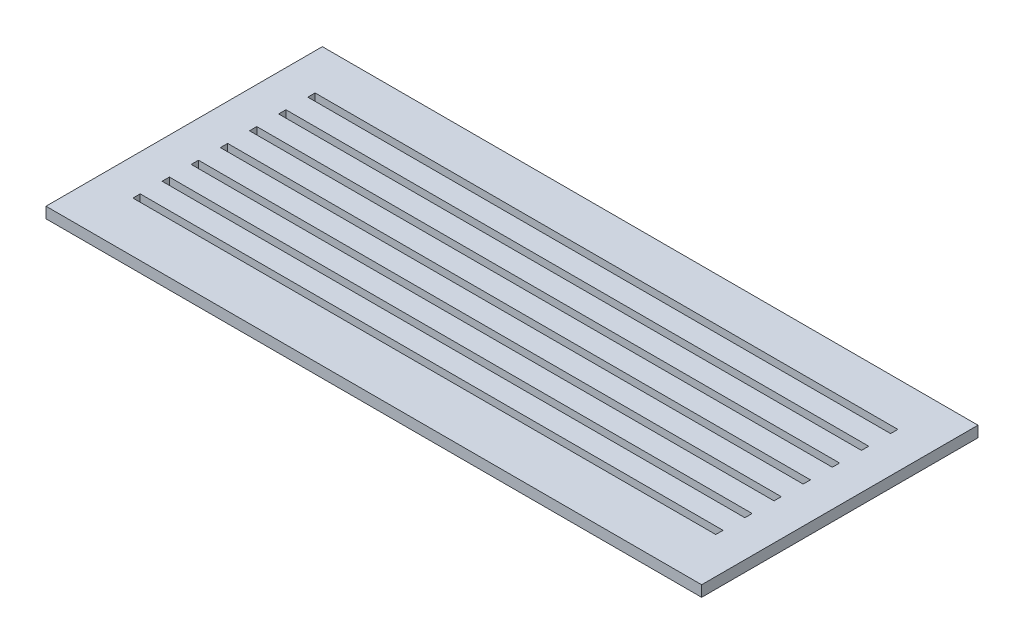
ISO-10303-21;
HEADER;
FILE_DESCRIPTION(('STEP AP214'),'2;1');
FILE_NAME('part.step','',(''),(''),'','','');
FILE_SCHEMA(('AUTOMOTIVE_DESIGN { 1 0 10303 214 1 1 1 1 }'));
ENDSEC;
DATA;
#1=APPLICATION_CONTEXT('core data for automotive mechanical design processes');
#2=APPLICATION_PROTOCOL_DEFINITION('international standard','automotive_design',2000,#1);
#3=PRODUCT_CONTEXT('',#1,'mechanical');
#4=PRODUCT('Part','Part','',(#3));
#5=PRODUCT_RELATED_PRODUCT_CATEGORY('part','',(#4));
#6=PRODUCT_DEFINITION_FORMATION('','',#4);
#7=PRODUCT_DEFINITION_CONTEXT('part definition',#1,'design');
#8=PRODUCT_DEFINITION('design','',#6,#7);
#9=PRODUCT_DEFINITION_SHAPE('','',#8);
#10=(LENGTH_UNIT() NAMED_UNIT(*) SI_UNIT(.MILLI.,.METRE.));
#11=(NAMED_UNIT(*) PLANE_ANGLE_UNIT() SI_UNIT($,.RADIAN.));
#12=(NAMED_UNIT(*) SI_UNIT($,.STERADIAN.) SOLID_ANGLE_UNIT());
#13=UNCERTAINTY_MEASURE_WITH_UNIT(LENGTH_MEASURE(1.E-05),#10,'distance_accuracy_value','');
#14=(GEOMETRIC_REPRESENTATION_CONTEXT(3) GLOBAL_UNCERTAINTY_ASSIGNED_CONTEXT((#13)) GLOBAL_UNIT_ASSIGNED_CONTEXT((#10,
#11,#12)) REPRESENTATION_CONTEXT('',''));
#15=CARTESIAN_POINT('',(0.,0.,0.));
#16=DIRECTION('',(0.,0.,1.));
#17=DIRECTION('',(1.,0.,0.));
#18=AXIS2_PLACEMENT_3D('',#15,#16,#17);
#19=CARTESIAN_POINT('',(0.,3.,0.));
#20=DIRECTION('',(0.,1.,0.));
#21=DIRECTION('',(0.,0.,1.));
#22=AXIS2_PLACEMENT_3D('',#19,#20,#21);
#23=PLANE('',#22);
#24=DIRECTION('',(0.,0.,1.));
#25=VECTOR('',#24,1.);
#26=CARTESIAN_POINT('',(-95.5669699429958,3.,-45.3964757709251));
#27=LINE('',#26,#25);
#28=CARTESIAN_POINT('',(-95.5669699429958,3.,-45.3964757709251));
#29=VERTEX_POINT('',#28);
#30=CARTESIAN_POINT('',(-95.5669699429957,3.,30.4735242290749));
#31=VERTEX_POINT('',#30);
#32=EDGE_CURVE('E464',#29,#31,#27,.T.);
#33=ORIENTED_EDGE('',*,*,#32,.T.);
#34=DIRECTION('',(1.,0.,0.));
#35=VECTOR('',#34,1.);
#36=CARTESIAN_POINT('',(-95.5669699429957,3.,30.4735242290749));
#37=LINE('',#36,#35);
#38=CARTESIAN_POINT('',(84.4330300570043,3.,30.4735242290749));
#39=VERTEX_POINT('',#38);
#40=EDGE_CURVE('E467',#31,#39,#37,.T.);
#41=ORIENTED_EDGE('',*,*,#40,.T.);
#42=DIRECTION('',(0.,0.,-1.));
#43=VECTOR('',#42,1.);
#44=CARTESIAN_POINT('',(84.4330300570043,3.,-45.3964757709251));
#45=LINE('',#44,#43);
#46=CARTESIAN_POINT('',(84.4330300570043,3.,-45.3964757709251));
#47=VERTEX_POINT('',#46);
#48=EDGE_CURVE('E470',#39,#47,#45,.T.);
#49=ORIENTED_EDGE('',*,*,#48,.T.);
#50=DIRECTION('',(-1.,0.,0.));
#51=VECTOR('',#50,1.);
#52=CARTESIAN_POINT('',(-95.5669699429958,3.,-45.3964757709251));
#53=LINE('',#52,#51);
#54=EDGE_CURVE('E472',#47,#29,#53,.T.);
#55=ORIENTED_EDGE('',*,*,#54,.T.);
#56=EDGE_LOOP('',(#33,#41,#49,#55));
#57=FACE_BOUND('',#56,.T.);
#58=DIRECTION('',(1.,0.,0.));
#59=VECTOR('',#58,1.);
#60=CARTESIAN_POINT('',(-85.5669699429958,3.,-31.3964757709251));
#61=LINE('',#60,#59);
#62=CARTESIAN_POINT('',(-85.5669699429958,3.,-31.3964757709251));
#63=VERTEX_POINT('',#62);
#64=CARTESIAN_POINT('',(74.4330300570042,3.,-31.3964757709251));
#65=VERTEX_POINT('',#64);
#66=EDGE_CURVE('E435',#63,#65,#61,.T.);
#67=ORIENTED_EDGE('',*,*,#66,.F.);
#68=DIRECTION('',(0.,0.,1.));
#69=VECTOR('',#68,1.);
#70=CARTESIAN_POINT('',(-85.5669699429958,3.,-33.3964757709251));
#71=LINE('',#70,#69);
#72=CARTESIAN_POINT('',(-85.5669699429958,3.,-33.3964757709251));
#73=VERTEX_POINT('',#72);
#74=EDGE_CURVE('E433',#73,#63,#71,.T.);
#75=ORIENTED_EDGE('',*,*,#74,.F.);
#76=DIRECTION('',(-1.,0.,0.));
#77=VECTOR('',#76,1.);
#78=CARTESIAN_POINT('',(-85.5669699429958,3.,-33.3964757709251));
#79=LINE('',#78,#77);
#80=CARTESIAN_POINT('',(74.4330300570042,3.,-33.3964757709251));
#81=VERTEX_POINT('',#80);
#82=EDGE_CURVE('E441',#81,#73,#79,.T.);
#83=ORIENTED_EDGE('',*,*,#82,.F.);
#84=DIRECTION('',(0.,0.,-1.));
#85=VECTOR('',#84,1.);
#86=CARTESIAN_POINT('',(74.4330300570042,3.,-33.3964757709251));
#87=LINE('',#86,#85);
#88=EDGE_CURVE('E438',#65,#81,#87,.T.);
#89=ORIENTED_EDGE('',*,*,#88,.F.);
#90=EDGE_LOOP('',(#67,#75,#83,#89));
#91=FACE_BOUND('',#90,.T.);
#92=DIRECTION('',(1.,0.,0.));
#93=VECTOR('',#92,1.);
#94=CARTESIAN_POINT('',(-85.5669699429957,3.,-23.3964757709251));
#95=LINE('',#94,#93);
#96=CARTESIAN_POINT('',(-85.5669699429957,3.,-23.3964757709251));
#97=VERTEX_POINT('',#96);
#98=CARTESIAN_POINT('',(74.4330300570043,3.,-23.3964757709251));
#99=VERTEX_POINT('',#98);
#100=EDGE_CURVE('E404',#97,#99,#95,.T.);
#101=ORIENTED_EDGE('',*,*,#100,.F.);
#102=DIRECTION('',(0.,0.,1.));
#103=VECTOR('',#102,1.);
#104=CARTESIAN_POINT('',(-85.5669699429957,3.,-25.3964757709251));
#105=LINE('',#104,#103);
#106=CARTESIAN_POINT('',(-85.5669699429957,3.,-25.3964757709251));
#107=VERTEX_POINT('',#106);
#108=EDGE_CURVE('E402',#107,#97,#105,.T.);
#109=ORIENTED_EDGE('',*,*,#108,.F.);
#110=DIRECTION('',(-1.,0.,0.));
#111=VECTOR('',#110,1.);
#112=CARTESIAN_POINT('',(-85.5669699429957,3.,-25.3964757709251));
#113=LINE('',#112,#111);
#114=CARTESIAN_POINT('',(74.4330300570043,3.,-25.3964757709251));
#115=VERTEX_POINT('',#114);
#116=EDGE_CURVE('E410',#115,#107,#113,.T.);
#117=ORIENTED_EDGE('',*,*,#116,.F.);
#118=DIRECTION('',(0.,0.,-1.));
#119=VECTOR('',#118,1.);
#120=CARTESIAN_POINT('',(74.4330300570043,3.,-25.3964757709251));
#121=LINE('',#120,#119);
#122=EDGE_CURVE('E407',#99,#115,#121,.T.);
#123=ORIENTED_EDGE('',*,*,#122,.F.);
#124=EDGE_LOOP('',(#101,#109,#117,#123));
#125=FACE_BOUND('',#124,.T.);
#126=DIRECTION('',(1.,0.,0.));
#127=VECTOR('',#126,1.);
#128=CARTESIAN_POINT('',(-85.5669699429956,3.,-15.3964757709251));
#129=LINE('',#128,#127);
#130=CARTESIAN_POINT('',(-85.5669699429956,3.,-15.3964757709251));
#131=VERTEX_POINT('',#130);
#132=CARTESIAN_POINT('',(74.4330300570044,3.,-15.3964757709251));
#133=VERTEX_POINT('',#132);
#134=EDGE_CURVE('E373',#131,#133,#129,.T.);
#135=ORIENTED_EDGE('',*,*,#134,.F.);
#136=DIRECTION('',(0.,0.,1.));
#137=VECTOR('',#136,1.);
#138=CARTESIAN_POINT('',(-85.5669699429956,3.,-17.3964757709251));
#139=LINE('',#138,#137);
#140=CARTESIAN_POINT('',(-85.5669699429956,3.,-17.3964757709251));
#141=VERTEX_POINT('',#140);
#142=EDGE_CURVE('E371',#141,#131,#139,.T.);
#143=ORIENTED_EDGE('',*,*,#142,.F.);
#144=DIRECTION('',(-1.,0.,0.));
#145=VECTOR('',#144,1.);
#146=CARTESIAN_POINT('',(-85.5669699429956,3.,-17.3964757709251));
#147=LINE('',#146,#145);
#148=CARTESIAN_POINT('',(74.4330300570044,3.,-17.3964757709251));
#149=VERTEX_POINT('',#148);
#150=EDGE_CURVE('E379',#149,#141,#147,.T.);
#151=ORIENTED_EDGE('',*,*,#150,.F.);
#152=DIRECTION('',(0.,0.,-1.));
#153=VECTOR('',#152,1.);
#154=CARTESIAN_POINT('',(74.4330300570044,3.,-17.3964757709251));
#155=LINE('',#154,#153);
#156=EDGE_CURVE('E376',#133,#149,#155,.T.);
#157=ORIENTED_EDGE('',*,*,#156,.F.);
#158=EDGE_LOOP('',(#135,#143,#151,#157));
#159=FACE_BOUND('',#158,.T.);
#160=DIRECTION('',(1.,0.,0.));
#161=VECTOR('',#160,1.);
#162=CARTESIAN_POINT('',(-85.5669699429955,3.,-7.39647577092511));
#163=LINE('',#162,#161);
#164=CARTESIAN_POINT('',(-85.5669699429955,3.,-7.39647577092511));
#165=VERTEX_POINT('',#164);
#166=CARTESIAN_POINT('',(74.4330300570045,3.,-7.39647577092511));
#167=VERTEX_POINT('',#166);
#168=EDGE_CURVE('E342',#165,#167,#163,.T.);
#169=ORIENTED_EDGE('',*,*,#168,.F.);
#170=DIRECTION('',(0.,0.,1.));
#171=VECTOR('',#170,1.);
#172=CARTESIAN_POINT('',(-85.5669699429955,3.,-9.39647577092511));
#173=LINE('',#172,#171);
#174=CARTESIAN_POINT('',(-85.5669699429955,3.,-9.39647577092511));
#175=VERTEX_POINT('',#174);
#176=EDGE_CURVE('E340',#175,#165,#173,.T.);
#177=ORIENTED_EDGE('',*,*,#176,.F.);
#178=DIRECTION('',(-1.,0.,0.));
#179=VECTOR('',#178,1.);
#180=CARTESIAN_POINT('',(-85.5669699429955,3.,-9.39647577092511));
#181=LINE('',#180,#179);
#182=CARTESIAN_POINT('',(74.4330300570045,3.,-9.39647577092511));
#183=VERTEX_POINT('',#182);
#184=EDGE_CURVE('E348',#183,#175,#181,.T.);
#185=ORIENTED_EDGE('',*,*,#184,.F.);
#186=DIRECTION('',(0.,0.,-1.));
#187=VECTOR('',#186,1.);
#188=CARTESIAN_POINT('',(74.4330300570045,3.,-9.39647577092511));
#189=LINE('',#188,#187);
#190=EDGE_CURVE('E345',#167,#183,#189,.T.);
#191=ORIENTED_EDGE('',*,*,#190,.F.);
#192=EDGE_LOOP('',(#169,#177,#185,#191));
#193=FACE_BOUND('',#192,.T.);
#194=DIRECTION('',(1.,0.,0.));
#195=VECTOR('',#194,1.);
#196=CARTESIAN_POINT('',(-85.5669699429954,3.,0.603524229074892));
#197=LINE('',#196,#195);
#198=CARTESIAN_POINT('',(-85.5669699429954,3.,0.603524229074892));
#199=VERTEX_POINT('',#198);
#200=CARTESIAN_POINT('',(74.4330300570046,3.,0.603524229074892));
#201=VERTEX_POINT('',#200);
#202=EDGE_CURVE('E311',#199,#201,#197,.T.);
#203=ORIENTED_EDGE('',*,*,#202,.F.);
#204=DIRECTION('',(0.,0.,1.));
#205=VECTOR('',#204,1.);
#206=CARTESIAN_POINT('',(-85.5669699429954,3.,-1.39647577092511));
#207=LINE('',#206,#205);
#208=CARTESIAN_POINT('',(-85.5669699429954,3.,-1.39647577092511));
#209=VERTEX_POINT('',#208);
#210=EDGE_CURVE('E309',#209,#199,#207,.T.);
#211=ORIENTED_EDGE('',*,*,#210,.F.);
#212=DIRECTION('',(-1.,0.,0.));
#213=VECTOR('',#212,1.);
#214=CARTESIAN_POINT('',(-85.5669699429954,3.,-1.39647577092511));
#215=LINE('',#214,#213);
#216=CARTESIAN_POINT('',(74.4330300570046,3.,-1.39647577092511));
#217=VERTEX_POINT('',#216);
#218=EDGE_CURVE('E317',#217,#209,#215,.T.);
#219=ORIENTED_EDGE('',*,*,#218,.F.);
#220=DIRECTION('',(0.,0.,-1.));
#221=VECTOR('',#220,1.);
#222=CARTESIAN_POINT('',(74.4330300570046,3.,-1.39647577092511));
#223=LINE('',#222,#221);
#224=EDGE_CURVE('E314',#201,#217,#223,.T.);
#225=ORIENTED_EDGE('',*,*,#224,.F.);
#226=EDGE_LOOP('',(#203,#211,#219,#225));
#227=FACE_BOUND('',#226,.T.);
#228=DIRECTION('',(1.,0.,0.));
#229=VECTOR('',#228,1.);
#230=CARTESIAN_POINT('',(-85.5669699429953,3.,8.60352422907489));
#231=LINE('',#230,#229);
#232=CARTESIAN_POINT('',(-85.5669699429953,3.,8.60352422907489));
#233=VERTEX_POINT('',#232);
#234=CARTESIAN_POINT('',(74.4330300570047,3.,8.60352422907489));
#235=VERTEX_POINT('',#234);
#236=EDGE_CURVE('E280',#233,#235,#231,.T.);
#237=ORIENTED_EDGE('',*,*,#236,.F.);
#238=DIRECTION('',(0.,0.,1.));
#239=VECTOR('',#238,1.);
#240=CARTESIAN_POINT('',(-85.5669699429953,3.,6.60352422907489));
#241=LINE('',#240,#239);
#242=CARTESIAN_POINT('',(-85.5669699429953,3.,6.60352422907489));
#243=VERTEX_POINT('',#242);
#244=EDGE_CURVE('E278',#243,#233,#241,.T.);
#245=ORIENTED_EDGE('',*,*,#244,.F.);
#246=DIRECTION('',(-1.,0.,0.));
#247=VECTOR('',#246,1.);
#248=CARTESIAN_POINT('',(-85.5669699429953,3.,6.60352422907489));
#249=LINE('',#248,#247);
#250=CARTESIAN_POINT('',(74.4330300570047,3.,6.60352422907489));
#251=VERTEX_POINT('',#250);
#252=EDGE_CURVE('E286',#251,#243,#249,.T.);
#253=ORIENTED_EDGE('',*,*,#252,.F.);
#254=DIRECTION('',(0.,0.,-1.));
#255=VECTOR('',#254,1.);
#256=CARTESIAN_POINT('',(74.4330300570047,3.,6.60352422907489));
#257=LINE('',#256,#255);
#258=EDGE_CURVE('E283',#235,#251,#257,.T.);
#259=ORIENTED_EDGE('',*,*,#258,.F.);
#260=EDGE_LOOP('',(#237,#245,#253,#259));
#261=FACE_BOUND('',#260,.T.);
#262=DIRECTION('',(1.,0.,0.));
#263=VECTOR('',#262,1.);
#264=CARTESIAN_POINT('',(-85.5669699429953,3.,16.6035242290749));
#265=LINE('',#264,#263);
#266=CARTESIAN_POINT('',(-85.5669699429953,3.,16.6035242290749));
#267=VERTEX_POINT('',#266);
#268=CARTESIAN_POINT('',(74.4330300570047,3.,16.6035242290749));
#269=VERTEX_POINT('',#268);
#270=EDGE_CURVE('E250',#267,#269,#265,.T.);
#271=ORIENTED_EDGE('',*,*,#270,.F.);
#272=DIRECTION('',(0.,0.,1.));
#273=VECTOR('',#272,1.);
#274=CARTESIAN_POINT('',(-85.5669699429953,3.,14.6035242290749));
#275=LINE('',#274,#273);
#276=CARTESIAN_POINT('',(-85.5669699429953,3.,14.6035242290749));
#277=VERTEX_POINT('',#276);
#278=EDGE_CURVE('E242',#277,#267,#275,.T.);
#279=ORIENTED_EDGE('',*,*,#278,.F.);
#280=DIRECTION('',(-1.,0.,0.));
#281=VECTOR('',#280,1.);
#282=CARTESIAN_POINT('',(-85.5669699429953,3.,14.6035242290749));
#283=LINE('',#282,#281);
#284=CARTESIAN_POINT('',(74.4330300570047,3.,14.6035242290749));
#285=VERTEX_POINT('',#284);
#286=EDGE_CURVE('E264',#285,#277,#283,.T.);
#287=ORIENTED_EDGE('',*,*,#286,.F.);
#288=DIRECTION('',(0.,0.,-1.));
#289=VECTOR('',#288,1.);
#290=CARTESIAN_POINT('',(74.4330300570047,3.,14.6035242290749));
#291=LINE('',#290,#289);
#292=EDGE_CURVE('E262',#269,#285,#291,.T.);
#293=ORIENTED_EDGE('',*,*,#292,.F.);
#294=EDGE_LOOP('',(#271,#279,#287,#293));
#295=FACE_BOUND('',#294,.T.);
#296=ADVANCED_FACE('F33',(#57,#91,#125,#159,#193,#227,#261,#295),#23,.T.);
#297=CARTESIAN_POINT('',(0.,0.,0.));
#298=DIRECTION('',(0.,1.,0.));
#299=DIRECTION('',(0.,0.,1.));
#300=AXIS2_PLACEMENT_3D('',#297,#298,#299);
#301=PLANE('',#300);
#302=DIRECTION('',(0.,0.,1.));
#303=VECTOR('',#302,1.);
#304=CARTESIAN_POINT('',(-85.5669699429953,0.,6.60352422907489));
#305=LINE('',#304,#303);
#306=CARTESIAN_POINT('',(-85.5669699429953,0.,6.60352422907489));
#307=VERTEX_POINT('',#306);
#308=CARTESIAN_POINT('',(-85.5669699429953,0.,8.60352422907489));
#309=VERTEX_POINT('',#308);
#310=EDGE_CURVE('E258',#307,#309,#305,.T.);
#311=ORIENTED_EDGE('',*,*,#310,.T.);
#312=DIRECTION('',(1.,0.,0.));
#313=VECTOR('',#312,1.);
#314=CARTESIAN_POINT('',(-85.5669699429953,0.,8.60352422907489));
#315=LINE('',#314,#313);
#316=CARTESIAN_POINT('',(74.4330300570047,0.,8.60352422907489));
#317=VERTEX_POINT('',#316);
#318=EDGE_CURVE('E291',#309,#317,#315,.T.);
#319=ORIENTED_EDGE('',*,*,#318,.T.);
#320=DIRECTION('',(0.,0.,-1.));
#321=VECTOR('',#320,1.);
#322=CARTESIAN_POINT('',(74.4330300570047,0.,6.60352422907489));
#323=LINE('',#322,#321);
#324=CARTESIAN_POINT('',(74.4330300570047,0.,6.60352422907489));
#325=VERTEX_POINT('',#324);
#326=EDGE_CURVE('E294',#317,#325,#323,.T.);
#327=ORIENTED_EDGE('',*,*,#326,.T.);
#328=DIRECTION('',(-1.,0.,0.));
#329=VECTOR('',#328,1.);
#330=CARTESIAN_POINT('',(-85.5669699429953,0.,6.60352422907489));
#331=LINE('',#330,#329);
#332=EDGE_CURVE('E281',#325,#307,#331,.T.);
#333=ORIENTED_EDGE('',*,*,#332,.T.);
#334=EDGE_LOOP('',(#311,#319,#327,#333));
#335=FACE_BOUND('',#334,.T.);
#336=DIRECTION('',(0.,0.,1.));
#337=VECTOR('',#336,1.);
#338=CARTESIAN_POINT('',(-85.5669699429955,0.,-9.39647577092511));
#339=LINE('',#338,#337);
#340=CARTESIAN_POINT('',(-85.5669699429955,0.,-9.39647577092511));
#341=VERTEX_POINT('',#340);
#342=CARTESIAN_POINT('',(-85.5669699429955,0.,-7.39647577092511));
#343=VERTEX_POINT('',#342);
#344=EDGE_CURVE('E339',#341,#343,#339,.T.);
#345=ORIENTED_EDGE('',*,*,#344,.T.);
#346=DIRECTION('',(1.,0.,0.));
#347=VECTOR('',#346,1.);
#348=CARTESIAN_POINT('',(-85.5669699429955,0.,-7.39647577092511));
#349=LINE('',#348,#347);
#350=CARTESIAN_POINT('',(74.4330300570045,0.,-7.39647577092511));
#351=VERTEX_POINT('',#350);
#352=EDGE_CURVE('E353',#343,#351,#349,.T.);
#353=ORIENTED_EDGE('',*,*,#352,.T.);
#354=DIRECTION('',(0.,0.,-1.));
#355=VECTOR('',#354,1.);
#356=CARTESIAN_POINT('',(74.4330300570045,0.,-9.39647577092511));
#357=LINE('',#356,#355);
#358=CARTESIAN_POINT('',(74.4330300570045,0.,-9.39647577092511));
#359=VERTEX_POINT('',#358);
#360=EDGE_CURVE('E356',#351,#359,#357,.T.);
#361=ORIENTED_EDGE('',*,*,#360,.T.);
#362=DIRECTION('',(-1.,0.,0.));
#363=VECTOR('',#362,1.);
#364=CARTESIAN_POINT('',(-85.5669699429955,0.,-9.39647577092511));
#365=LINE('',#364,#363);
#366=EDGE_CURVE('E343',#359,#341,#365,.T.);
#367=ORIENTED_EDGE('',*,*,#366,.T.);
#368=EDGE_LOOP('',(#345,#353,#361,#367));
#369=FACE_BOUND('',#368,.T.);
#370=DIRECTION('',(0.,0.,1.));
#371=VECTOR('',#370,1.);
#372=CARTESIAN_POINT('',(-85.5669699429957,0.,-25.3964757709251));
#373=LINE('',#372,#371);
#374=CARTESIAN_POINT('',(-85.5669699429957,0.,-25.3964757709251));
#375=VERTEX_POINT('',#374);
#376=CARTESIAN_POINT('',(-85.5669699429957,0.,-23.3964757709251));
#377=VERTEX_POINT('',#376);
#378=EDGE_CURVE('E401',#375,#377,#373,.T.);
#379=ORIENTED_EDGE('',*,*,#378,.T.);
#380=DIRECTION('',(1.,0.,0.));
#381=VECTOR('',#380,1.);
#382=CARTESIAN_POINT('',(-85.5669699429957,0.,-23.3964757709251));
#383=LINE('',#382,#381);
#384=CARTESIAN_POINT('',(74.4330300570043,0.,-23.3964757709251));
#385=VERTEX_POINT('',#384);
#386=EDGE_CURVE('E415',#377,#385,#383,.T.);
#387=ORIENTED_EDGE('',*,*,#386,.T.);
#388=DIRECTION('',(0.,0.,-1.));
#389=VECTOR('',#388,1.);
#390=CARTESIAN_POINT('',(74.4330300570043,0.,-25.3964757709251));
#391=LINE('',#390,#389);
#392=CARTESIAN_POINT('',(74.4330300570043,0.,-25.3964757709251));
#393=VERTEX_POINT('',#392);
#394=EDGE_CURVE('E418',#385,#393,#391,.T.);
#395=ORIENTED_EDGE('',*,*,#394,.T.);
#396=DIRECTION('',(-1.,0.,0.));
#397=VECTOR('',#396,1.);
#398=CARTESIAN_POINT('',(-85.5669699429957,0.,-25.3964757709251));
#399=LINE('',#398,#397);
#400=EDGE_CURVE('E405',#393,#375,#399,.T.);
#401=ORIENTED_EDGE('',*,*,#400,.T.);
#402=EDGE_LOOP('',(#379,#387,#395,#401));
#403=FACE_BOUND('',#402,.T.);
#404=DIRECTION('',(0.,0.,1.));
#405=VECTOR('',#404,1.);
#406=CARTESIAN_POINT('',(-95.5669699429958,0.,-45.3964757709251));
#407=LINE('',#406,#405);
#408=CARTESIAN_POINT('',(-95.5669699429958,0.,-45.3964757709251));
#409=VERTEX_POINT('',#408);
#410=CARTESIAN_POINT('',(-95.5669699429957,0.,30.4735242290749));
#411=VERTEX_POINT('',#410);
#412=EDGE_CURVE('E463',#409,#411,#407,.T.);
#413=ORIENTED_EDGE('',*,*,#412,.F.);
#414=DIRECTION('',(-1.,0.,0.));
#415=VECTOR('',#414,1.);
#416=CARTESIAN_POINT('',(-95.5669699429958,0.,-45.3964757709251));
#417=LINE('',#416,#415);
#418=CARTESIAN_POINT('',(84.4330300570043,0.,-45.3964757709251));
#419=VERTEX_POINT('',#418);
#420=EDGE_CURVE('E468',#419,#409,#417,.T.);
#421=ORIENTED_EDGE('',*,*,#420,.F.);
#422=DIRECTION('',(0.,0.,-1.));
#423=VECTOR('',#422,1.);
#424=CARTESIAN_POINT('',(84.4330300570043,0.,-45.3964757709251));
#425=LINE('',#424,#423);
#426=CARTESIAN_POINT('',(84.4330300570043,0.,30.4735242290749));
#427=VERTEX_POINT('',#426);
#428=EDGE_CURVE('E479',#427,#419,#425,.T.);
#429=ORIENTED_EDGE('',*,*,#428,.F.);
#430=DIRECTION('',(1.,0.,0.));
#431=VECTOR('',#430,1.);
#432=CARTESIAN_POINT('',(-95.5669699429957,0.,30.4735242290749));
#433=LINE('',#432,#431);
#434=EDGE_CURVE('E477',#411,#427,#433,.T.);
#435=ORIENTED_EDGE('',*,*,#434,.F.);
#436=EDGE_LOOP('',(#413,#421,#429,#435));
#437=FACE_BOUND('',#436,.T.);
#438=DIRECTION('',(0.,0.,1.));
#439=VECTOR('',#438,1.);
#440=CARTESIAN_POINT('',(-85.5669699429958,0.,-33.3964757709251));
#441=LINE('',#440,#439);
#442=CARTESIAN_POINT('',(-85.5669699429958,0.,-33.3964757709251));
#443=VERTEX_POINT('',#442);
#444=CARTESIAN_POINT('',(-85.5669699429958,0.,-31.3964757709251));
#445=VERTEX_POINT('',#444);
#446=EDGE_CURVE('E432',#443,#445,#441,.T.);
#447=ORIENTED_EDGE('',*,*,#446,.T.);
#448=DIRECTION('',(1.,0.,0.));
#449=VECTOR('',#448,1.);
#450=CARTESIAN_POINT('',(-85.5669699429958,0.,-31.3964757709251));
#451=LINE('',#450,#449);
#452=CARTESIAN_POINT('',(74.4330300570042,0.,-31.3964757709251));
#453=VERTEX_POINT('',#452);
#454=EDGE_CURVE('E446',#445,#453,#451,.T.);
#455=ORIENTED_EDGE('',*,*,#454,.T.);
#456=DIRECTION('',(0.,0.,-1.));
#457=VECTOR('',#456,1.);
#458=CARTESIAN_POINT('',(74.4330300570042,0.,-33.3964757709251));
#459=LINE('',#458,#457);
#460=CARTESIAN_POINT('',(74.4330300570042,0.,-33.3964757709251));
#461=VERTEX_POINT('',#460);
#462=EDGE_CURVE('E449',#453,#461,#459,.T.);
#463=ORIENTED_EDGE('',*,*,#462,.T.);
#464=DIRECTION('',(-1.,0.,0.));
#465=VECTOR('',#464,1.);
#466=CARTESIAN_POINT('',(-85.5669699429958,0.,-33.3964757709251));
#467=LINE('',#466,#465);
#468=EDGE_CURVE('E436',#461,#443,#467,.T.);
#469=ORIENTED_EDGE('',*,*,#468,.T.);
#470=EDGE_LOOP('',(#447,#455,#463,#469));
#471=FACE_BOUND('',#470,.T.);
#472=DIRECTION('',(0.,0.,1.));
#473=VECTOR('',#472,1.);
#474=CARTESIAN_POINT('',(-85.5669699429956,0.,-17.3964757709251));
#475=LINE('',#474,#473);
#476=CARTESIAN_POINT('',(-85.5669699429956,0.,-17.3964757709251));
#477=VERTEX_POINT('',#476);
#478=CARTESIAN_POINT('',(-85.5669699429956,0.,-15.3964757709251));
#479=VERTEX_POINT('',#478);
#480=EDGE_CURVE('E370',#477,#479,#475,.T.);
#481=ORIENTED_EDGE('',*,*,#480,.T.);
#482=DIRECTION('',(1.,0.,0.));
#483=VECTOR('',#482,1.);
#484=CARTESIAN_POINT('',(-85.5669699429956,0.,-15.3964757709251));
#485=LINE('',#484,#483);
#486=CARTESIAN_POINT('',(74.4330300570044,0.,-15.3964757709251));
#487=VERTEX_POINT('',#486);
#488=EDGE_CURVE('E384',#479,#487,#485,.T.);
#489=ORIENTED_EDGE('',*,*,#488,.T.);
#490=DIRECTION('',(0.,0.,-1.));
#491=VECTOR('',#490,1.);
#492=CARTESIAN_POINT('',(74.4330300570044,0.,-17.3964757709251));
#493=LINE('',#492,#491);
#494=CARTESIAN_POINT('',(74.4330300570044,0.,-17.3964757709251));
#495=VERTEX_POINT('',#494);
#496=EDGE_CURVE('E387',#487,#495,#493,.T.);
#497=ORIENTED_EDGE('',*,*,#496,.T.);
#498=DIRECTION('',(-1.,0.,0.));
#499=VECTOR('',#498,1.);
#500=CARTESIAN_POINT('',(-85.5669699429956,0.,-17.3964757709251));
#501=LINE('',#500,#499);
#502=EDGE_CURVE('E374',#495,#477,#501,.T.);
#503=ORIENTED_EDGE('',*,*,#502,.T.);
#504=EDGE_LOOP('',(#481,#489,#497,#503));
#505=FACE_BOUND('',#504,.T.);
#506=DIRECTION('',(0.,0.,1.));
#507=VECTOR('',#506,1.);
#508=CARTESIAN_POINT('',(-85.5669699429954,0.,-1.39647577092511));
#509=LINE('',#508,#507);
#510=CARTESIAN_POINT('',(-85.5669699429954,0.,-1.39647577092511));
#511=VERTEX_POINT('',#510);
#512=CARTESIAN_POINT('',(-85.5669699429954,0.,0.603524229074892));
#513=VERTEX_POINT('',#512);
#514=EDGE_CURVE('E308',#511,#513,#509,.T.);
#515=ORIENTED_EDGE('',*,*,#514,.T.);
#516=DIRECTION('',(1.,0.,0.));
#517=VECTOR('',#516,1.);
#518=CARTESIAN_POINT('',(-85.5669699429954,0.,0.603524229074892));
#519=LINE('',#518,#517);
#520=CARTESIAN_POINT('',(74.4330300570046,0.,0.603524229074892));
#521=VERTEX_POINT('',#520);
#522=EDGE_CURVE('E322',#513,#521,#519,.T.);
#523=ORIENTED_EDGE('',*,*,#522,.T.);
#524=DIRECTION('',(0.,0.,-1.));
#525=VECTOR('',#524,1.);
#526=CARTESIAN_POINT('',(74.4330300570046,0.,-1.39647577092511));
#527=LINE('',#526,#525);
#528=CARTESIAN_POINT('',(74.4330300570046,0.,-1.39647577092511));
#529=VERTEX_POINT('',#528);
#530=EDGE_CURVE('E325',#521,#529,#527,.T.);
#531=ORIENTED_EDGE('',*,*,#530,.T.);
#532=DIRECTION('',(-1.,0.,0.));
#533=VECTOR('',#532,1.);
#534=CARTESIAN_POINT('',(-85.5669699429954,0.,-1.39647577092511));
#535=LINE('',#534,#533);
#536=EDGE_CURVE('E312',#529,#511,#535,.T.);
#537=ORIENTED_EDGE('',*,*,#536,.T.);
#538=EDGE_LOOP('',(#515,#523,#531,#537));
#539=FACE_BOUND('',#538,.T.);
#540=DIRECTION('',(0.,0.,1.));
#541=VECTOR('',#540,1.);
#542=CARTESIAN_POINT('',(-85.5669699429953,0.,14.6035242290749));
#543=LINE('',#542,#541);
#544=CARTESIAN_POINT('',(-85.5669699429953,0.,14.6035242290749));
#545=VERTEX_POINT('',#544);
#546=CARTESIAN_POINT('',(-85.5669699429953,0.,16.6035242290749));
#547=VERTEX_POINT('',#546);
#548=EDGE_CURVE('E56',#545,#547,#543,.T.);
#549=ORIENTED_EDGE('',*,*,#548,.T.);
#550=DIRECTION('',(1.,0.,0.));
#551=VECTOR('',#550,1.);
#552=CARTESIAN_POINT('',(-85.5669699429953,0.,16.6035242290749));
#553=LINE('',#552,#551);
#554=CARTESIAN_POINT('',(74.4330300570047,0.,16.6035242290749));
#555=VERTEX_POINT('',#554);
#556=EDGE_CURVE('E257',#547,#555,#553,.T.);
#557=ORIENTED_EDGE('',*,*,#556,.T.);
#558=DIRECTION('',(0.,0.,-1.));
#559=VECTOR('',#558,1.);
#560=CARTESIAN_POINT('',(74.4330300570047,0.,14.6035242290749));
#561=LINE('',#560,#559);
#562=CARTESIAN_POINT('',(74.4330300570047,0.,14.6035242290749));
#563=VERTEX_POINT('',#562);
#564=EDGE_CURVE('E270',#555,#563,#561,.T.);
#565=ORIENTED_EDGE('',*,*,#564,.T.);
#566=DIRECTION('',(-1.,0.,0.));
#567=VECTOR('',#566,1.);
#568=CARTESIAN_POINT('',(-85.5669699429953,0.,14.6035242290749));
#569=LINE('',#568,#567);
#570=EDGE_CURVE('E251',#563,#545,#569,.T.);
#571=ORIENTED_EDGE('',*,*,#570,.T.);
#572=EDGE_LOOP('',(#549,#557,#565,#571));
#573=FACE_BOUND('',#572,.T.);
#574=ADVANCED_FACE('F497',(#335,#369,#403,#437,#471,#505,#539,#573),#301,.F.);
#575=CARTESIAN_POINT('',(-95.5669699429958,3.,-45.3964757709251));
#576=DIRECTION('',(1.,0.,0.));
#577=DIRECTION('',(0.,0.,-1.));
#578=AXIS2_PLACEMENT_3D('',#575,#576,#577);
#579=PLANE('',#578);
#580=ORIENTED_EDGE('',*,*,#412,.T.);
#581=DIRECTION('',(0.,-1.,0.));
#582=VECTOR('',#581,1.);
#583=CARTESIAN_POINT('',(-95.5669699429957,3.,30.4735242290749));
#584=LINE('',#583,#582);
#585=EDGE_CURVE('E11',#31,#411,#584,.T.);
#586=ORIENTED_EDGE('',*,*,#585,.F.);
#587=ORIENTED_EDGE('',*,*,#32,.F.);
#588=DIRECTION('',(0.,-1.,0.));
#589=VECTOR('',#588,1.);
#590=CARTESIAN_POINT('',(-95.5669699429958,3.,-45.3964757709251));
#591=LINE('',#590,#589);
#592=EDGE_CURVE('E474',#29,#409,#591,.T.);
#593=ORIENTED_EDGE('',*,*,#592,.T.);
#594=EDGE_LOOP('',(#580,#586,#587,#593));
#595=FACE_BOUND('',#594,.T.);
#596=ADVANCED_FACE('F35',(#595),#579,.F.);
#597=CARTESIAN_POINT('',(-95.5669699429957,3.,30.4735242290749));
#598=DIRECTION('',(0.,0.,-1.));
#599=DIRECTION('',(-1.,0.,0.));
#600=AXIS2_PLACEMENT_3D('',#597,#598,#599);
#601=PLANE('',#600);
#602=ORIENTED_EDGE('',*,*,#434,.T.);
#603=DIRECTION('',(0.,-1.,0.));
#604=VECTOR('',#603,1.);
#605=CARTESIAN_POINT('',(84.4330300570043,3.,30.4735242290749));
#606=LINE('',#605,#604);
#607=EDGE_CURVE('E41',#39,#427,#606,.T.);
#608=ORIENTED_EDGE('',*,*,#607,.F.);
#609=ORIENTED_EDGE('',*,*,#40,.F.);
#610=ORIENTED_EDGE('',*,*,#585,.T.);
#611=EDGE_LOOP('',(#602,#608,#609,#610));
#612=FACE_BOUND('',#611,.T.);
#613=ADVANCED_FACE('F508',(#612),#601,.F.);
#614=CARTESIAN_POINT('',(84.4330300570043,3.,-45.3964757709251));
#615=DIRECTION('',(-1.,0.,0.));
#616=DIRECTION('',(0.,0.,1.));
#617=AXIS2_PLACEMENT_3D('',#614,#615,#616);
#618=PLANE('',#617);
#619=ORIENTED_EDGE('',*,*,#428,.T.);
#620=DIRECTION('',(0.,-1.,0.));
#621=VECTOR('',#620,1.);
#622=CARTESIAN_POINT('',(84.4330300570043,3.,-45.3964757709251));
#623=LINE('',#622,#621);
#624=EDGE_CURVE('E484',#47,#419,#623,.T.);
#625=ORIENTED_EDGE('',*,*,#624,.F.);
#626=ORIENTED_EDGE('',*,*,#48,.F.);
#627=ORIENTED_EDGE('',*,*,#607,.T.);
#628=EDGE_LOOP('',(#619,#625,#626,#627));
#629=FACE_BOUND('',#628,.T.);
#630=ADVANCED_FACE('F491',(#629),#618,.F.);
#631=CARTESIAN_POINT('',(-95.5669699429958,3.,-45.3964757709251));
#632=DIRECTION('',(0.,0.,1.));
#633=DIRECTION('',(1.,0.,0.));
#634=AXIS2_PLACEMENT_3D('',#631,#632,#633);
#635=PLANE('',#634);
#636=ORIENTED_EDGE('',*,*,#420,.T.);
#637=ORIENTED_EDGE('',*,*,#592,.F.);
#638=ORIENTED_EDGE('',*,*,#54,.F.);
#639=ORIENTED_EDGE('',*,*,#624,.T.);
#640=EDGE_LOOP('',(#636,#637,#638,#639));
#641=FACE_BOUND('',#640,.T.);
#642=ADVANCED_FACE('F501',(#641),#635,.F.);
#643=CARTESIAN_POINT('',(-85.5669699429958,3.,-33.3964757709251));
#644=DIRECTION('',(1.,0.,0.));
#645=DIRECTION('',(0.,0.,-1.));
#646=AXIS2_PLACEMENT_3D('',#643,#644,#645);
#647=PLANE('',#646);
#648=ORIENTED_EDGE('',*,*,#446,.F.);
#649=DIRECTION('',(0.,-1.,0.));
#650=VECTOR('',#649,1.);
#651=CARTESIAN_POINT('',(-85.5669699429958,3.,-33.3964757709251));
#652=LINE('',#651,#650);
#653=EDGE_CURVE('E443',#73,#443,#652,.T.);
#654=ORIENTED_EDGE('',*,*,#653,.F.);
#655=ORIENTED_EDGE('',*,*,#74,.T.);
#656=DIRECTION('',(0.,-1.,0.));
#657=VECTOR('',#656,1.);
#658=CARTESIAN_POINT('',(-85.5669699429958,3.,-31.3964757709251));
#659=LINE('',#658,#657);
#660=EDGE_CURVE('E460',#63,#445,#659,.T.);
#661=ORIENTED_EDGE('',*,*,#660,.T.);
#662=EDGE_LOOP('',(#648,#654,#655,#661));
#663=FACE_BOUND('',#662,.T.);
#664=ADVANCED_FACE('F523',(#663),#647,.T.);
#665=CARTESIAN_POINT('',(-85.5669699429958,3.,-31.3964757709251));
#666=DIRECTION('',(0.,0.,-1.));
#667=DIRECTION('',(-1.,0.,0.));
#668=AXIS2_PLACEMENT_3D('',#665,#666,#667);
#669=PLANE('',#668);
#670=ORIENTED_EDGE('',*,*,#454,.F.);
#671=ORIENTED_EDGE('',*,*,#660,.F.);
#672=ORIENTED_EDGE('',*,*,#66,.T.);
#673=DIRECTION('',(0.,-1.,0.));
#674=VECTOR('',#673,1.);
#675=CARTESIAN_POINT('',(74.4330300570042,3.,-31.3964757709251));
#676=LINE('',#675,#674);
#677=EDGE_CURVE('E458',#65,#453,#676,.T.);
#678=ORIENTED_EDGE('',*,*,#677,.T.);
#679=EDGE_LOOP('',(#670,#671,#672,#678));
#680=FACE_BOUND('',#679,.T.);
#681=ADVANCED_FACE('F530',(#680),#669,.T.);
#682=CARTESIAN_POINT('',(74.4330300570042,3.,-33.3964757709251));
#683=DIRECTION('',(-1.,0.,0.));
#684=DIRECTION('',(0.,0.,1.));
#685=AXIS2_PLACEMENT_3D('',#682,#683,#684);
#686=PLANE('',#685);
#687=ORIENTED_EDGE('',*,*,#462,.F.);
#688=ORIENTED_EDGE('',*,*,#677,.F.);
#689=ORIENTED_EDGE('',*,*,#88,.T.);
#690=DIRECTION('',(0.,-1.,0.));
#691=VECTOR('',#690,1.);
#692=CARTESIAN_POINT('',(74.4330300570042,3.,-33.3964757709251));
#693=LINE('',#692,#691);
#694=EDGE_CURVE('E456',#81,#461,#693,.T.);
#695=ORIENTED_EDGE('',*,*,#694,.T.);
#696=EDGE_LOOP('',(#687,#688,#689,#695));
#697=FACE_BOUND('',#696,.T.);
#698=ADVANCED_FACE('F535',(#697),#686,.T.);
#699=CARTESIAN_POINT('',(-85.5669699429958,3.,-33.3964757709251));
#700=DIRECTION('',(0.,0.,1.));
#701=DIRECTION('',(1.,0.,0.));
#702=AXIS2_PLACEMENT_3D('',#699,#700,#701);
#703=PLANE('',#702);
#704=ORIENTED_EDGE('',*,*,#468,.F.);
#705=ORIENTED_EDGE('',*,*,#694,.F.);
#706=ORIENTED_EDGE('',*,*,#82,.T.);
#707=ORIENTED_EDGE('',*,*,#653,.T.);
#708=EDGE_LOOP('',(#704,#705,#706,#707));
#709=FACE_BOUND('',#708,.T.);
#710=ADVANCED_FACE('F542',(#709),#703,.T.);
#711=CARTESIAN_POINT('',(-85.5669699429957,3.,-25.3964757709251));
#712=DIRECTION('',(1.,0.,0.));
#713=DIRECTION('',(0.,0.,-1.));
#714=AXIS2_PLACEMENT_3D('',#711,#712,#713);
#715=PLANE('',#714);
#716=ORIENTED_EDGE('',*,*,#378,.F.);
#717=DIRECTION('',(0.,-1.,0.));
#718=VECTOR('',#717,1.);
#719=CARTESIAN_POINT('',(-85.5669699429957,3.,-25.3964757709251));
#720=LINE('',#719,#718);
#721=EDGE_CURVE('E412',#107,#375,#720,.T.);
#722=ORIENTED_EDGE('',*,*,#721,.F.);
#723=ORIENTED_EDGE('',*,*,#108,.T.);
#724=DIRECTION('',(0.,-1.,0.));
#725=VECTOR('',#724,1.);
#726=CARTESIAN_POINT('',(-85.5669699429957,3.,-23.3964757709251));
#727=LINE('',#726,#725);
#728=EDGE_CURVE('E429',#97,#377,#727,.T.);
#729=ORIENTED_EDGE('',*,*,#728,.T.);
#730=EDGE_LOOP('',(#716,#722,#723,#729));
#731=FACE_BOUND('',#730,.T.);
#732=ADVANCED_FACE('F658',(#731),#715,.T.);
#733=CARTESIAN_POINT('',(-85.5669699429957,3.,-23.3964757709251));
#734=DIRECTION('',(0.,0.,-1.));
#735=DIRECTION('',(-1.,0.,0.));
#736=AXIS2_PLACEMENT_3D('',#733,#734,#735);
#737=PLANE('',#736);
#738=ORIENTED_EDGE('',*,*,#386,.F.);
#739=ORIENTED_EDGE('',*,*,#728,.F.);
#740=ORIENTED_EDGE('',*,*,#100,.T.);
#741=DIRECTION('',(0.,-1.,0.));
#742=VECTOR('',#741,1.);
#743=CARTESIAN_POINT('',(74.4330300570043,3.,-23.3964757709251));
#744=LINE('',#743,#742);
#745=EDGE_CURVE('E427',#99,#385,#744,.T.);
#746=ORIENTED_EDGE('',*,*,#745,.T.);
#747=EDGE_LOOP('',(#738,#739,#740,#746));
#748=FACE_BOUND('',#747,.T.);
#749=ADVANCED_FACE('F654',(#748),#737,.T.);
#750=CARTESIAN_POINT('',(74.4330300570043,3.,-25.3964757709251));
#751=DIRECTION('',(-1.,0.,0.));
#752=DIRECTION('',(0.,0.,1.));
#753=AXIS2_PLACEMENT_3D('',#750,#751,#752);
#754=PLANE('',#753);
#755=ORIENTED_EDGE('',*,*,#394,.F.);
#756=ORIENTED_EDGE('',*,*,#745,.F.);
#757=ORIENTED_EDGE('',*,*,#122,.T.);
#758=DIRECTION('',(0.,-1.,0.));
#759=VECTOR('',#758,1.);
#760=CARTESIAN_POINT('',(74.4330300570043,3.,-25.3964757709251));
#761=LINE('',#760,#759);
#762=EDGE_CURVE('E425',#115,#393,#761,.T.);
#763=ORIENTED_EDGE('',*,*,#762,.T.);
#764=EDGE_LOOP('',(#755,#756,#757,#763));
#765=FACE_BOUND('',#764,.T.);
#766=ADVANCED_FACE('F650',(#765),#754,.T.);
#767=CARTESIAN_POINT('',(-85.5669699429957,3.,-25.3964757709251));
#768=DIRECTION('',(0.,0.,1.));
#769=DIRECTION('',(1.,0.,0.));
#770=AXIS2_PLACEMENT_3D('',#767,#768,#769);
#771=PLANE('',#770);
#772=ORIENTED_EDGE('',*,*,#400,.F.);
#773=ORIENTED_EDGE('',*,*,#762,.F.);
#774=ORIENTED_EDGE('',*,*,#116,.T.);
#775=ORIENTED_EDGE('',*,*,#721,.T.);
#776=EDGE_LOOP('',(#772,#773,#774,#775));
#777=FACE_BOUND('',#776,.T.);
#778=ADVANCED_FACE('F646',(#777),#771,.T.);
#779=CARTESIAN_POINT('',(-85.5669699429956,3.,-17.3964757709251));
#780=DIRECTION('',(1.,0.,0.));
#781=DIRECTION('',(0.,0.,-1.));
#782=AXIS2_PLACEMENT_3D('',#779,#780,#781);
#783=PLANE('',#782);
#784=ORIENTED_EDGE('',*,*,#480,.F.);
#785=DIRECTION('',(0.,-1.,0.));
#786=VECTOR('',#785,1.);
#787=CARTESIAN_POINT('',(-85.5669699429956,3.,-17.3964757709251));
#788=LINE('',#787,#786);
#789=EDGE_CURVE('E381',#141,#477,#788,.T.);
#790=ORIENTED_EDGE('',*,*,#789,.F.);
#791=ORIENTED_EDGE('',*,*,#142,.T.);
#792=DIRECTION('',(0.,-1.,0.));
#793=VECTOR('',#792,1.);
#794=CARTESIAN_POINT('',(-85.5669699429956,3.,-15.3964757709251));
#795=LINE('',#794,#793);
#796=EDGE_CURVE('E398',#131,#479,#795,.T.);
#797=ORIENTED_EDGE('',*,*,#796,.T.);
#798=EDGE_LOOP('',(#784,#790,#791,#797));
#799=FACE_BOUND('',#798,.T.);
#800=ADVANCED_FACE('F642',(#799),#783,.T.);
#801=CARTESIAN_POINT('',(-85.5669699429956,3.,-15.3964757709251));
#802=DIRECTION('',(0.,0.,-1.));
#803=DIRECTION('',(-1.,0.,0.));
#804=AXIS2_PLACEMENT_3D('',#801,#802,#803);
#805=PLANE('',#804);
#806=ORIENTED_EDGE('',*,*,#488,.F.);
#807=ORIENTED_EDGE('',*,*,#796,.F.);
#808=ORIENTED_EDGE('',*,*,#134,.T.);
#809=DIRECTION('',(0.,-1.,0.));
#810=VECTOR('',#809,1.);
#811=CARTESIAN_POINT('',(74.4330300570044,3.,-15.3964757709251));
#812=LINE('',#811,#810);
#813=EDGE_CURVE('E396',#133,#487,#812,.T.);
#814=ORIENTED_EDGE('',*,*,#813,.T.);
#815=EDGE_LOOP('',(#806,#807,#808,#814));
#816=FACE_BOUND('',#815,.T.);
#817=ADVANCED_FACE('F638',(#816),#805,.T.);
#818=CARTESIAN_POINT('',(74.4330300570044,3.,-17.3964757709251));
#819=DIRECTION('',(-1.,0.,0.));
#820=DIRECTION('',(0.,0.,1.));
#821=AXIS2_PLACEMENT_3D('',#818,#819,#820);
#822=PLANE('',#821);
#823=ORIENTED_EDGE('',*,*,#496,.F.);
#824=ORIENTED_EDGE('',*,*,#813,.F.);
#825=ORIENTED_EDGE('',*,*,#156,.T.);
#826=DIRECTION('',(0.,-1.,0.));
#827=VECTOR('',#826,1.);
#828=CARTESIAN_POINT('',(74.4330300570044,3.,-17.3964757709251));
#829=LINE('',#828,#827);
#830=EDGE_CURVE('E394',#149,#495,#829,.T.);
#831=ORIENTED_EDGE('',*,*,#830,.T.);
#832=EDGE_LOOP('',(#823,#824,#825,#831));
#833=FACE_BOUND('',#832,.T.);
#834=ADVANCED_FACE('F634',(#833),#822,.T.);
#835=CARTESIAN_POINT('',(-85.5669699429956,3.,-17.3964757709251));
#836=DIRECTION('',(0.,0.,1.));
#837=DIRECTION('',(1.,0.,0.));
#838=AXIS2_PLACEMENT_3D('',#835,#836,#837);
#839=PLANE('',#838);
#840=ORIENTED_EDGE('',*,*,#502,.F.);
#841=ORIENTED_EDGE('',*,*,#830,.F.);
#842=ORIENTED_EDGE('',*,*,#150,.T.);
#843=ORIENTED_EDGE('',*,*,#789,.T.);
#844=EDGE_LOOP('',(#840,#841,#842,#843));
#845=FACE_BOUND('',#844,.T.);
#846=ADVANCED_FACE('F630',(#845),#839,.T.);
#847=CARTESIAN_POINT('',(-85.5669699429955,3.,-9.39647577092511));
#848=DIRECTION('',(1.,0.,0.));
#849=DIRECTION('',(0.,0.,-1.));
#850=AXIS2_PLACEMENT_3D('',#847,#848,#849);
#851=PLANE('',#850);
#852=ORIENTED_EDGE('',*,*,#344,.F.);
#853=DIRECTION('',(0.,-1.,0.));
#854=VECTOR('',#853,1.);
#855=CARTESIAN_POINT('',(-85.5669699429955,3.,-9.39647577092511));
#856=LINE('',#855,#854);
#857=EDGE_CURVE('E350',#175,#341,#856,.T.);
#858=ORIENTED_EDGE('',*,*,#857,.F.);
#859=ORIENTED_EDGE('',*,*,#176,.T.);
#860=DIRECTION('',(0.,-1.,0.));
#861=VECTOR('',#860,1.);
#862=CARTESIAN_POINT('',(-85.5669699429955,3.,-7.39647577092511));
#863=LINE('',#862,#861);
#864=EDGE_CURVE('E367',#165,#343,#863,.T.);
#865=ORIENTED_EDGE('',*,*,#864,.T.);
#866=EDGE_LOOP('',(#852,#858,#859,#865));
#867=FACE_BOUND('',#866,.T.);
#868=ADVANCED_FACE('F626',(#867),#851,.T.);
#869=CARTESIAN_POINT('',(-85.5669699429955,3.,-7.39647577092511));
#870=DIRECTION('',(0.,0.,-1.));
#871=DIRECTION('',(-1.,0.,0.));
#872=AXIS2_PLACEMENT_3D('',#869,#870,#871);
#873=PLANE('',#872);
#874=ORIENTED_EDGE('',*,*,#352,.F.);
#875=ORIENTED_EDGE('',*,*,#864,.F.);
#876=ORIENTED_EDGE('',*,*,#168,.T.);
#877=DIRECTION('',(0.,-1.,0.));
#878=VECTOR('',#877,1.);
#879=CARTESIAN_POINT('',(74.4330300570045,3.,-7.39647577092511));
#880=LINE('',#879,#878);
#881=EDGE_CURVE('E365',#167,#351,#880,.T.);
#882=ORIENTED_EDGE('',*,*,#881,.T.);
#883=EDGE_LOOP('',(#874,#875,#876,#882));
#884=FACE_BOUND('',#883,.T.);
#885=ADVANCED_FACE('F622',(#884),#873,.T.);
#886=CARTESIAN_POINT('',(74.4330300570045,3.,-9.39647577092511));
#887=DIRECTION('',(-1.,0.,0.));
#888=DIRECTION('',(0.,0.,1.));
#889=AXIS2_PLACEMENT_3D('',#886,#887,#888);
#890=PLANE('',#889);
#891=ORIENTED_EDGE('',*,*,#360,.F.);
#892=ORIENTED_EDGE('',*,*,#881,.F.);
#893=ORIENTED_EDGE('',*,*,#190,.T.);
#894=DIRECTION('',(0.,-1.,0.));
#895=VECTOR('',#894,1.);
#896=CARTESIAN_POINT('',(74.4330300570045,3.,-9.39647577092511));
#897=LINE('',#896,#895);
#898=EDGE_CURVE('E363',#183,#359,#897,.T.);
#899=ORIENTED_EDGE('',*,*,#898,.T.);
#900=EDGE_LOOP('',(#891,#892,#893,#899));
#901=FACE_BOUND('',#900,.T.);
#902=ADVANCED_FACE('F618',(#901),#890,.T.);
#903=CARTESIAN_POINT('',(-85.5669699429955,3.,-9.39647577092511));
#904=DIRECTION('',(0.,0.,1.));
#905=DIRECTION('',(1.,0.,0.));
#906=AXIS2_PLACEMENT_3D('',#903,#904,#905);
#907=PLANE('',#906);
#908=ORIENTED_EDGE('',*,*,#366,.F.);
#909=ORIENTED_EDGE('',*,*,#898,.F.);
#910=ORIENTED_EDGE('',*,*,#184,.T.);
#911=ORIENTED_EDGE('',*,*,#857,.T.);
#912=EDGE_LOOP('',(#908,#909,#910,#911));
#913=FACE_BOUND('',#912,.T.);
#914=ADVANCED_FACE('F614',(#913),#907,.T.);
#915=CARTESIAN_POINT('',(-85.5669699429954,3.,-1.39647577092511));
#916=DIRECTION('',(1.,0.,0.));
#917=DIRECTION('',(0.,0.,-1.));
#918=AXIS2_PLACEMENT_3D('',#915,#916,#917);
#919=PLANE('',#918);
#920=ORIENTED_EDGE('',*,*,#514,.F.);
#921=DIRECTION('',(0.,-1.,0.));
#922=VECTOR('',#921,1.);
#923=CARTESIAN_POINT('',(-85.5669699429954,3.,-1.39647577092511));
#924=LINE('',#923,#922);
#925=EDGE_CURVE('E319',#209,#511,#924,.T.);
#926=ORIENTED_EDGE('',*,*,#925,.F.);
#927=ORIENTED_EDGE('',*,*,#210,.T.);
#928=DIRECTION('',(0.,-1.,0.));
#929=VECTOR('',#928,1.);
#930=CARTESIAN_POINT('',(-85.5669699429954,3.,0.603524229074892));
#931=LINE('',#930,#929);
#932=EDGE_CURVE('E336',#199,#513,#931,.T.);
#933=ORIENTED_EDGE('',*,*,#932,.T.);
#934=EDGE_LOOP('',(#920,#926,#927,#933));
#935=FACE_BOUND('',#934,.T.);
#936=ADVANCED_FACE('F610',(#935),#919,.T.);
#937=CARTESIAN_POINT('',(-85.5669699429954,3.,0.603524229074892));
#938=DIRECTION('',(0.,0.,-1.));
#939=DIRECTION('',(-1.,0.,0.));
#940=AXIS2_PLACEMENT_3D('',#937,#938,#939);
#941=PLANE('',#940);
#942=ORIENTED_EDGE('',*,*,#522,.F.);
#943=ORIENTED_EDGE('',*,*,#932,.F.);
#944=ORIENTED_EDGE('',*,*,#202,.T.);
#945=DIRECTION('',(0.,-1.,0.));
#946=VECTOR('',#945,1.);
#947=CARTESIAN_POINT('',(74.4330300570046,3.,0.603524229074892));
#948=LINE('',#947,#946);
#949=EDGE_CURVE('E334',#201,#521,#948,.T.);
#950=ORIENTED_EDGE('',*,*,#949,.T.);
#951=EDGE_LOOP('',(#942,#943,#944,#950));
#952=FACE_BOUND('',#951,.T.);
#953=ADVANCED_FACE('F606',(#952),#941,.T.);
#954=CARTESIAN_POINT('',(74.4330300570046,3.,-1.39647577092511));
#955=DIRECTION('',(-1.,0.,0.));
#956=DIRECTION('',(0.,0.,1.));
#957=AXIS2_PLACEMENT_3D('',#954,#955,#956);
#958=PLANE('',#957);
#959=ORIENTED_EDGE('',*,*,#530,.F.);
#960=ORIENTED_EDGE('',*,*,#949,.F.);
#961=ORIENTED_EDGE('',*,*,#224,.T.);
#962=DIRECTION('',(0.,-1.,0.));
#963=VECTOR('',#962,1.);
#964=CARTESIAN_POINT('',(74.4330300570046,3.,-1.39647577092511));
#965=LINE('',#964,#963);
#966=EDGE_CURVE('E332',#217,#529,#965,.T.);
#967=ORIENTED_EDGE('',*,*,#966,.T.);
#968=EDGE_LOOP('',(#959,#960,#961,#967));
#969=FACE_BOUND('',#968,.T.);
#970=ADVANCED_FACE('F602',(#969),#958,.T.);
#971=CARTESIAN_POINT('',(-85.5669699429954,3.,-1.39647577092511));
#972=DIRECTION('',(0.,0.,1.));
#973=DIRECTION('',(1.,0.,0.));
#974=AXIS2_PLACEMENT_3D('',#971,#972,#973);
#975=PLANE('',#974);
#976=ORIENTED_EDGE('',*,*,#536,.F.);
#977=ORIENTED_EDGE('',*,*,#966,.F.);
#978=ORIENTED_EDGE('',*,*,#218,.T.);
#979=ORIENTED_EDGE('',*,*,#925,.T.);
#980=EDGE_LOOP('',(#976,#977,#978,#979));
#981=FACE_BOUND('',#980,.T.);
#982=ADVANCED_FACE('F599',(#981),#975,.T.);
#983=CARTESIAN_POINT('',(-85.5669699429953,3.,6.60352422907489));
#984=DIRECTION('',(1.,0.,0.));
#985=DIRECTION('',(0.,0.,-1.));
#986=AXIS2_PLACEMENT_3D('',#983,#984,#985);
#987=PLANE('',#986);
#988=ORIENTED_EDGE('',*,*,#310,.F.);
#989=DIRECTION('',(0.,-1.,0.));
#990=VECTOR('',#989,1.);
#991=CARTESIAN_POINT('',(-85.5669699429953,3.,6.60352422907489));
#992=LINE('',#991,#990);
#993=EDGE_CURVE('E288',#243,#307,#992,.T.);
#994=ORIENTED_EDGE('',*,*,#993,.F.);
#995=ORIENTED_EDGE('',*,*,#244,.T.);
#996=DIRECTION('',(0.,-1.,0.));
#997=VECTOR('',#996,1.);
#998=CARTESIAN_POINT('',(-85.5669699429953,3.,8.60352422907489));
#999=LINE('',#998,#997);
#1000=EDGE_CURVE('E305',#233,#309,#999,.T.);
#1001=ORIENTED_EDGE('',*,*,#1000,.T.);
#1002=EDGE_LOOP('',(#988,#994,#995,#1001));
#1003=FACE_BOUND('',#1002,.T.);
#1004=ADVANCED_FACE('F581',(#1003),#987,.T.);
#1005=CARTESIAN_POINT('',(-85.5669699429953,3.,8.60352422907489));
#1006=DIRECTION('',(0.,0.,-1.));
#1007=DIRECTION('',(-1.,0.,0.));
#1008=AXIS2_PLACEMENT_3D('',#1005,#1006,#1007);
#1009=PLANE('',#1008);
#1010=ORIENTED_EDGE('',*,*,#318,.F.);
#1011=ORIENTED_EDGE('',*,*,#1000,.F.);
#1012=ORIENTED_EDGE('',*,*,#236,.T.);
#1013=DIRECTION('',(0.,-1.,0.));
#1014=VECTOR('',#1013,1.);
#1015=CARTESIAN_POINT('',(74.4330300570047,3.,8.60352422907489));
#1016=LINE('',#1015,#1014);
#1017=EDGE_CURVE('E303',#235,#317,#1016,.T.);
#1018=ORIENTED_EDGE('',*,*,#1017,.T.);
#1019=EDGE_LOOP('',(#1010,#1011,#1012,#1018));
#1020=FACE_BOUND('',#1019,.T.);
#1021=ADVANCED_FACE('F574',(#1020),#1009,.T.);
#1022=CARTESIAN_POINT('',(74.4330300570047,3.,6.60352422907489));
#1023=DIRECTION('',(-1.,0.,0.));
#1024=DIRECTION('',(0.,0.,1.));
#1025=AXIS2_PLACEMENT_3D('',#1022,#1023,#1024);
#1026=PLANE('',#1025);
#1027=ORIENTED_EDGE('',*,*,#326,.F.);
#1028=ORIENTED_EDGE('',*,*,#1017,.F.);
#1029=ORIENTED_EDGE('',*,*,#258,.T.);
#1030=DIRECTION('',(0.,-1.,0.));
#1031=VECTOR('',#1030,1.);
#1032=CARTESIAN_POINT('',(74.4330300570047,3.,6.60352422907489));
#1033=LINE('',#1032,#1031);
#1034=EDGE_CURVE('E301',#251,#325,#1033,.T.);
#1035=ORIENTED_EDGE('',*,*,#1034,.T.);
#1036=EDGE_LOOP('',(#1027,#1028,#1029,#1035));
#1037=FACE_BOUND('',#1036,.T.);
#1038=ADVANCED_FACE('F577',(#1037),#1026,.T.);
#1039=CARTESIAN_POINT('',(-85.5669699429953,3.,6.60352422907489));
#1040=DIRECTION('',(0.,0.,1.));
#1041=DIRECTION('',(1.,0.,0.));
#1042=AXIS2_PLACEMENT_3D('',#1039,#1040,#1041);
#1043=PLANE('',#1042);
#1044=ORIENTED_EDGE('',*,*,#332,.F.);
#1045=ORIENTED_EDGE('',*,*,#1034,.F.);
#1046=ORIENTED_EDGE('',*,*,#252,.T.);
#1047=ORIENTED_EDGE('',*,*,#993,.T.);
#1048=EDGE_LOOP('',(#1044,#1045,#1046,#1047));
#1049=FACE_BOUND('',#1048,.T.);
#1050=ADVANCED_FACE('F584',(#1049),#1043,.T.);
#1051=CARTESIAN_POINT('',(-85.5669699429953,3.,14.6035242290749));
#1052=DIRECTION('',(1.,0.,0.));
#1053=DIRECTION('',(0.,0.,-1.));
#1054=AXIS2_PLACEMENT_3D('',#1051,#1052,#1053);
#1055=PLANE('',#1054);
#1056=ORIENTED_EDGE('',*,*,#548,.F.);
#1057=DIRECTION('',(0.,-1.,0.));
#1058=VECTOR('',#1057,1.);
#1059=CARTESIAN_POINT('',(-85.5669699429953,3.,14.6035242290749));
#1060=LINE('',#1059,#1058);
#1061=EDGE_CURVE('E246',#277,#545,#1060,.T.);
#1062=ORIENTED_EDGE('',*,*,#1061,.F.);
#1063=ORIENTED_EDGE('',*,*,#278,.T.);
#1064=DIRECTION('',(0.,-1.,0.));
#1065=VECTOR('',#1064,1.);
#1066=CARTESIAN_POINT('',(-85.5669699429953,3.,16.6035242290749));
#1067=LINE('',#1066,#1065);
#1068=EDGE_CURVE('E245',#267,#547,#1067,.T.);
#1069=ORIENTED_EDGE('',*,*,#1068,.T.);
#1070=EDGE_LOOP('',(#1056,#1062,#1063,#1069));
#1071=FACE_BOUND('',#1070,.T.);
#1072=ADVANCED_FACE('F244',(#1071),#1055,.T.);
#1073=CARTESIAN_POINT('',(-85.5669699429953,3.,16.6035242290749));
#1074=DIRECTION('',(0.,0.,-1.));
#1075=DIRECTION('',(-1.,0.,0.));
#1076=AXIS2_PLACEMENT_3D('',#1073,#1074,#1075);
#1077=PLANE('',#1076);
#1078=ORIENTED_EDGE('',*,*,#556,.F.);
#1079=ORIENTED_EDGE('',*,*,#1068,.F.);
#1080=ORIENTED_EDGE('',*,*,#270,.T.);
#1081=DIRECTION('',(0.,-1.,0.));
#1082=VECTOR('',#1081,1.);
#1083=CARTESIAN_POINT('',(74.4330300570047,3.,16.6035242290749));
#1084=LINE('',#1083,#1082);
#1085=EDGE_CURVE('E259',#269,#555,#1084,.T.);
#1086=ORIENTED_EDGE('',*,*,#1085,.T.);
#1087=EDGE_LOOP('',(#1078,#1079,#1080,#1086));
#1088=FACE_BOUND('',#1087,.T.);
#1089=ADVANCED_FACE('F254',(#1088),#1077,.T.);
#1090=CARTESIAN_POINT('',(74.4330300570047,3.,14.6035242290749));
#1091=DIRECTION('',(-1.,0.,0.));
#1092=DIRECTION('',(0.,0.,1.));
#1093=AXIS2_PLACEMENT_3D('',#1090,#1091,#1092);
#1094=PLANE('',#1093);
#1095=ORIENTED_EDGE('',*,*,#564,.F.);
#1096=ORIENTED_EDGE('',*,*,#1085,.F.);
#1097=ORIENTED_EDGE('',*,*,#292,.T.);
#1098=DIRECTION('',(0.,-1.,0.));
#1099=VECTOR('',#1098,1.);
#1100=CARTESIAN_POINT('',(74.4330300570047,3.,14.6035242290749));
#1101=LINE('',#1100,#1099);
#1102=EDGE_CURVE('E48',#285,#563,#1101,.T.);
#1103=ORIENTED_EDGE('',*,*,#1102,.T.);
#1104=EDGE_LOOP('',(#1095,#1096,#1097,#1103));
#1105=FACE_BOUND('',#1104,.T.);
#1106=ADVANCED_FACE('F769',(#1105),#1094,.T.);
#1107=CARTESIAN_POINT('',(-85.5669699429953,3.,14.6035242290749));
#1108=DIRECTION('',(0.,0.,1.));
#1109=DIRECTION('',(1.,0.,0.));
#1110=AXIS2_PLACEMENT_3D('',#1107,#1108,#1109);
#1111=PLANE('',#1110);
#1112=ORIENTED_EDGE('',*,*,#570,.F.);
#1113=ORIENTED_EDGE('',*,*,#1102,.F.);
#1114=ORIENTED_EDGE('',*,*,#286,.T.);
#1115=ORIENTED_EDGE('',*,*,#1061,.T.);
#1116=EDGE_LOOP('',(#1112,#1113,#1114,#1115));
#1117=FACE_BOUND('',#1116,.T.);
#1118=ADVANCED_FACE('F777',(#1117),#1111,.T.);
#1119=CLOSED_SHELL('',(#296,#574,#596,#613,#630,#642,#664,#681,#698,#710,#732,#749,#766,#778,
#800,#817,#834,#846,#868,#885,#902,#914,#936,#953,#970,#982,#1004,#1021,#1038,#1050,#1072,#1089,
#1106,#1118));
#1120=MANIFOLD_SOLID_BREP('B2',#1119);
#1121=ADVANCED_BREP_SHAPE_REPRESENTATION('',(#18,#1120),#14);
#1122=SHAPE_DEFINITION_REPRESENTATION(#9,#1121);
ENDSEC;
END-ISO-10303-21;
